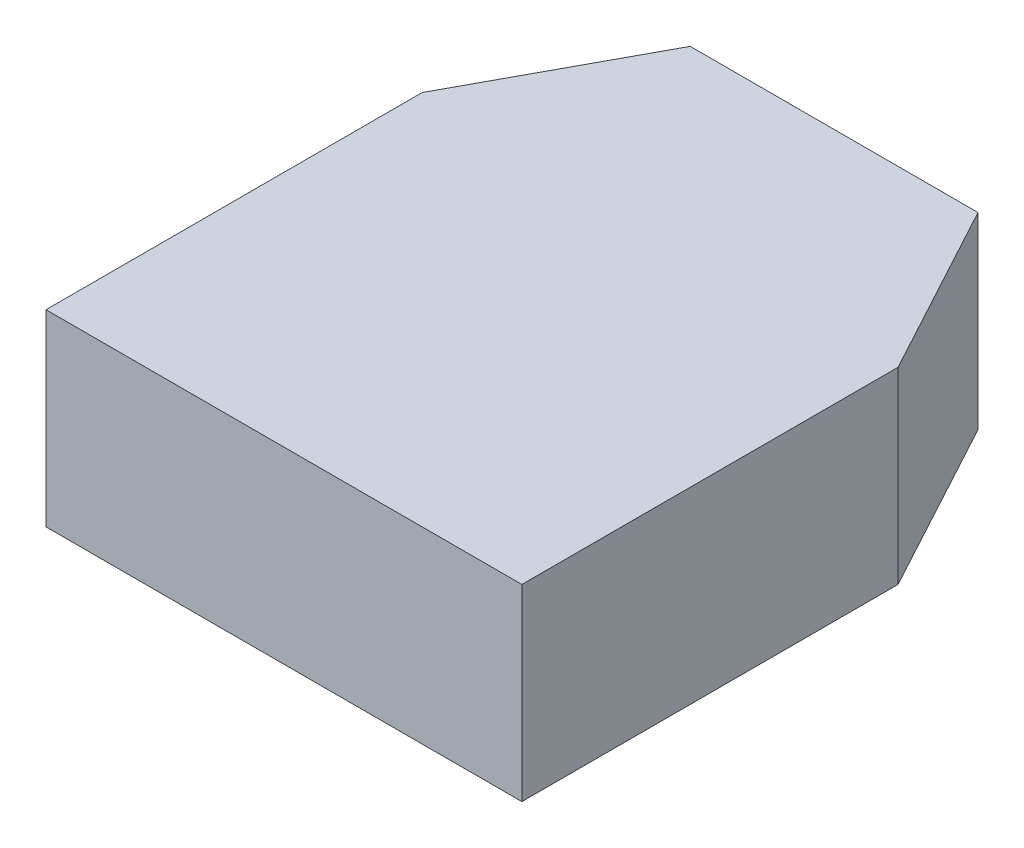
ISO-10303-21;
HEADER;
FILE_DESCRIPTION(('STEP AP214'),'2;1');
FILE_NAME('part.step','',(''),(''),'','','');
FILE_SCHEMA(('AUTOMOTIVE_DESIGN { 1 0 10303 214 1 1 1 1 }'));
ENDSEC;
DATA;
#1=APPLICATION_CONTEXT('core data for automotive mechanical design processes');
#2=APPLICATION_PROTOCOL_DEFINITION('international standard','automotive_design',2000,#1);
#3=PRODUCT_CONTEXT('',#1,'mechanical');
#4=PRODUCT('Part','Part','',(#3));
#5=PRODUCT_RELATED_PRODUCT_CATEGORY('part','',(#4));
#6=PRODUCT_DEFINITION_FORMATION('','',#4);
#7=PRODUCT_DEFINITION_CONTEXT('part definition',#1,'design');
#8=PRODUCT_DEFINITION('design','',#6,#7);
#9=PRODUCT_DEFINITION_SHAPE('','',#8);
#10=(LENGTH_UNIT() NAMED_UNIT(*) SI_UNIT(.MILLI.,.METRE.));
#11=(NAMED_UNIT(*) PLANE_ANGLE_UNIT() SI_UNIT($,.RADIAN.));
#12=(NAMED_UNIT(*) SI_UNIT($,.STERADIAN.) SOLID_ANGLE_UNIT());
#13=UNCERTAINTY_MEASURE_WITH_UNIT(LENGTH_MEASURE(1.E-05),#10,'distance_accuracy_value','');
#14=(GEOMETRIC_REPRESENTATION_CONTEXT(3) GLOBAL_UNCERTAINTY_ASSIGNED_CONTEXT((#13)) GLOBAL_UNIT_ASSIGNED_CONTEXT((#10,
#11,#12)) REPRESENTATION_CONTEXT('',''));
#15=CARTESIAN_POINT('',(0.,0.,0.));
#16=DIRECTION('',(0.,0.,1.));
#17=DIRECTION('',(1.,0.,0.));
#18=AXIS2_PLACEMENT_3D('',#15,#16,#17);
#19=CARTESIAN_POINT('',(-50.6,20.,0.));
#20=DIRECTION('',(1.,0.,0.));
#21=DIRECTION('',(0.,0.,-1.));
#22=AXIS2_PLACEMENT_3D('',#19,#20,#21);
#23=PLANE('',#22);
#24=DIRECTION('',(0.,0.,1.));
#25=VECTOR('',#24,1.);
#26=CARTESIAN_POINT('',(-50.6,0.,0.));
#27=LINE('',#26,#25);
#28=CARTESIAN_POINT('',(-50.6,0.,-40.));
#29=VERTEX_POINT('',#28);
#30=CARTESIAN_POINT('',(-50.6,0.,0.));
#31=VERTEX_POINT('',#30);
#32=EDGE_CURVE('E117',#29,#31,#27,.T.);
#33=ORIENTED_EDGE('',*,*,#32,.T.);
#34=DIRECTION('',(0.,-1.,0.));
#35=VECTOR('',#34,1.);
#36=CARTESIAN_POINT('',(-50.6,20.,0.));
#37=LINE('',#36,#35);
#38=CARTESIAN_POINT('',(-50.6,20.,0.));
#39=VERTEX_POINT('',#38);
#40=EDGE_CURVE('E11',#39,#31,#37,.T.);
#41=ORIENTED_EDGE('',*,*,#40,.F.);
#42=DIRECTION('',(0.,0.,1.));
#43=VECTOR('',#42,1.);
#44=CARTESIAN_POINT('',(-50.6,20.,0.));
#45=LINE('',#44,#43);
#46=CARTESIAN_POINT('',(-50.6,20.,-40.));
#47=VERTEX_POINT('',#46);
#48=EDGE_CURVE('E127',#47,#39,#45,.T.);
#49=ORIENTED_EDGE('',*,*,#48,.F.);
#50=DIRECTION('',(0.,-1.,0.));
#51=VECTOR('',#50,1.);
#52=CARTESIAN_POINT('',(-50.6,20.,-40.));
#53=LINE('',#52,#51);
#54=EDGE_CURVE('E113',#47,#29,#53,.T.);
#55=ORIENTED_EDGE('',*,*,#54,.T.);
#56=EDGE_LOOP('',(#33,#41,#49,#55));
#57=FACE_BOUND('',#56,.T.);
#58=ADVANCED_FACE('F33',(#57),#23,.F.);
#59=CARTESIAN_POINT('',(0.,20.,0.));
#60=DIRECTION('',(0.,0.,-1.));
#61=DIRECTION('',(-1.,0.,0.));
#62=AXIS2_PLACEMENT_3D('',#59,#60,#61);
#63=PLANE('',#62);
#64=DIRECTION('',(1.,0.,0.));
#65=VECTOR('',#64,1.);
#66=CARTESIAN_POINT('',(0.,0.,0.));
#67=LINE('',#66,#65);
#68=CARTESIAN_POINT('',(0.,0.,0.));
#69=VERTEX_POINT('',#68);
#70=EDGE_CURVE('E120',#31,#69,#67,.T.);
#71=ORIENTED_EDGE('',*,*,#70,.T.);
#72=DIRECTION('',(0.,-1.,0.));
#73=VECTOR('',#72,1.);
#74=CARTESIAN_POINT('',(0.,20.,0.));
#75=LINE('',#74,#73);
#76=CARTESIAN_POINT('',(0.,20.,0.));
#77=VERTEX_POINT('',#76);
#78=EDGE_CURVE('E41',#77,#69,#75,.T.);
#79=ORIENTED_EDGE('',*,*,#78,.F.);
#80=DIRECTION('',(1.,0.,0.));
#81=VECTOR('',#80,1.);
#82=CARTESIAN_POINT('',(0.,20.,0.));
#83=LINE('',#82,#81);
#84=EDGE_CURVE('E86',#39,#77,#83,.T.);
#85=ORIENTED_EDGE('',*,*,#84,.F.);
#86=ORIENTED_EDGE('',*,*,#40,.T.);
#87=EDGE_LOOP('',(#71,#79,#85,#86));
#88=FACE_BOUND('',#87,.T.);
#89=ADVANCED_FACE('F151',(#88),#63,.F.);
#90=CARTESIAN_POINT('',(0.,20.,-40.));
#91=DIRECTION('',(-1.,0.,0.));
#92=DIRECTION('',(0.,0.,1.));
#93=AXIS2_PLACEMENT_3D('',#90,#91,#92);
#94=PLANE('',#93);
#95=DIRECTION('',(0.,0.,-1.));
#96=VECTOR('',#95,1.);
#97=CARTESIAN_POINT('',(0.,0.,-40.));
#98=LINE('',#97,#96);
#99=CARTESIAN_POINT('',(0.,0.,-40.));
#100=VERTEX_POINT('',#99);
#101=EDGE_CURVE('E122',#69,#100,#98,.T.);
#102=ORIENTED_EDGE('',*,*,#101,.T.);
#103=DIRECTION('',(0.,-1.,0.));
#104=VECTOR('',#103,1.);
#105=CARTESIAN_POINT('',(0.,20.,-40.));
#106=LINE('',#105,#104);
#107=CARTESIAN_POINT('',(0.,20.,-40.));
#108=VERTEX_POINT('',#107);
#109=EDGE_CURVE('E108',#108,#100,#106,.T.);
#110=ORIENTED_EDGE('',*,*,#109,.F.);
#111=DIRECTION('',(0.,0.,-1.));
#112=VECTOR('',#111,1.);
#113=CARTESIAN_POINT('',(0.,20.,-40.));
#114=LINE('',#113,#112);
#115=EDGE_CURVE('E99',#77,#108,#114,.T.);
#116=ORIENTED_EDGE('',*,*,#115,.F.);
#117=ORIENTED_EDGE('',*,*,#78,.T.);
#118=EDGE_LOOP('',(#102,#110,#116,#117));
#119=FACE_BOUND('',#118,.T.);
#120=ADVANCED_FACE('F133',(#119),#94,.F.);
#121=CARTESIAN_POINT('',(-9.99999999999999,20.,-58.5));
#122=DIRECTION('',(-0.879706513576127,0.,0.475517034365474));
#123=DIRECTION('',(0.475517034365474,0.,0.879706513576127));
#124=AXIS2_PLACEMENT_3D('',#121,#122,#123);
#125=PLANE('',#124);
#126=DIRECTION('',(-0.475517034365474,0.,-0.879706513576127));
#127=VECTOR('',#126,1.);
#128=CARTESIAN_POINT('',(-9.99999999999999,0.,-58.5));
#129=LINE('',#128,#127);
#130=CARTESIAN_POINT('',(-9.99999999999999,0.,-58.5));
#131=VERTEX_POINT('',#130);
#132=EDGE_CURVE('E107',#100,#131,#129,.T.);
#133=ORIENTED_EDGE('',*,*,#132,.T.);
#134=DIRECTION('',(0.,-1.,0.));
#135=VECTOR('',#134,1.);
#136=CARTESIAN_POINT('',(-9.99999999999999,20.,-58.5));
#137=LINE('',#136,#135);
#138=CARTESIAN_POINT('',(-9.99999999999999,20.,-58.5));
#139=VERTEX_POINT('',#138);
#140=EDGE_CURVE('E104',#139,#131,#137,.T.);
#141=ORIENTED_EDGE('',*,*,#140,.F.);
#142=DIRECTION('',(-0.475517034365474,0.,-0.879706513576127));
#143=VECTOR('',#142,1.);
#144=CARTESIAN_POINT('',(-9.99999999999999,20.,-58.5));
#145=LINE('',#144,#143);
#146=EDGE_CURVE('E93',#108,#139,#145,.T.);
#147=ORIENTED_EDGE('',*,*,#146,.F.);
#148=ORIENTED_EDGE('',*,*,#109,.T.);
#149=EDGE_LOOP('',(#133,#141,#147,#148));
#150=FACE_BOUND('',#149,.T.);
#151=ADVANCED_FACE('F105',(#150),#125,.F.);
#152=CARTESIAN_POINT('',(-40.6,20.,-58.5));
#153=DIRECTION('',(0.,0.,1.));
#154=DIRECTION('',(1.,0.,0.));
#155=AXIS2_PLACEMENT_3D('',#152,#153,#154);
#156=PLANE('',#155);
#157=DIRECTION('',(-1.,0.,0.));
#158=VECTOR('',#157,1.);
#159=CARTESIAN_POINT('',(-40.6,0.,-58.5));
#160=LINE('',#159,#158);
#161=CARTESIAN_POINT('',(-40.6,0.,-58.5));
#162=VERTEX_POINT('',#161);
#163=EDGE_CURVE('E72',#131,#162,#160,.T.);
#164=ORIENTED_EDGE('',*,*,#163,.T.);
#165=DIRECTION('',(0.,-1.,0.));
#166=VECTOR('',#165,1.);
#167=CARTESIAN_POINT('',(-40.6,20.,-58.5));
#168=LINE('',#167,#166);
#169=CARTESIAN_POINT('',(-40.6,20.,-58.5));
#170=VERTEX_POINT('',#169);
#171=EDGE_CURVE('E109',#170,#162,#168,.T.);
#172=ORIENTED_EDGE('',*,*,#171,.F.);
#173=DIRECTION('',(-1.,0.,0.));
#174=VECTOR('',#173,1.);
#175=CARTESIAN_POINT('',(-40.6,20.,-58.5));
#176=LINE('',#175,#174);
#177=EDGE_CURVE('E97',#139,#170,#176,.T.);
#178=ORIENTED_EDGE('',*,*,#177,.F.);
#179=ORIENTED_EDGE('',*,*,#140,.T.);
#180=EDGE_LOOP('',(#164,#172,#178,#179));
#181=FACE_BOUND('',#180,.T.);
#182=ADVANCED_FACE('F111',(#181),#156,.F.);
#183=CARTESIAN_POINT('',(-50.6,20.,-40.));
#184=DIRECTION('',(0.879706513576127,0.,0.475517034365474));
#185=DIRECTION('',(0.475517034365474,0.,-0.879706513576127));
#186=AXIS2_PLACEMENT_3D('',#183,#184,#185);
#187=PLANE('',#186);
#188=DIRECTION('',(-0.475517034365474,0.,0.879706513576127));
#189=VECTOR('',#188,1.);
#190=CARTESIAN_POINT('',(-50.6,0.,-40.));
#191=LINE('',#190,#189);
#192=EDGE_CURVE('E78',#162,#29,#191,.T.);
#193=ORIENTED_EDGE('',*,*,#192,.T.);
#194=ORIENTED_EDGE('',*,*,#54,.F.);
#195=DIRECTION('',(-0.475517034365474,0.,0.879706513576127));
#196=VECTOR('',#195,1.);
#197=CARTESIAN_POINT('',(-50.6,20.,-40.));
#198=LINE('',#197,#196);
#199=EDGE_CURVE('E49',#170,#47,#198,.T.);
#200=ORIENTED_EDGE('',*,*,#199,.F.);
#201=ORIENTED_EDGE('',*,*,#171,.T.);
#202=EDGE_LOOP('',(#193,#194,#200,#201));
#203=FACE_BOUND('',#202,.T.);
#204=ADVANCED_FACE('F140',(#203),#187,.F.);
#205=CARTESIAN_POINT('',(0.,20.,0.));
#206=DIRECTION('',(0.,-1.,0.));
#207=DIRECTION('',(0.,0.,-1.));
#208=AXIS2_PLACEMENT_3D('',#205,#206,#207);
#209=PLANE('',#208);
#210=ORIENTED_EDGE('',*,*,#48,.T.);
#211=ORIENTED_EDGE('',*,*,#84,.T.);
#212=ORIENTED_EDGE('',*,*,#115,.T.);
#213=ORIENTED_EDGE('',*,*,#146,.T.);
#214=ORIENTED_EDGE('',*,*,#177,.T.);
#215=ORIENTED_EDGE('',*,*,#199,.T.);
#216=EDGE_LOOP('',(#210,#211,#212,#213,#214,#215));
#217=FACE_BOUND('',#216,.T.);
#218=ADVANCED_FACE('F95',(#217),#209,.F.);
#219=CARTESIAN_POINT('',(0.,0.,0.));
#220=DIRECTION('',(0.,-1.,0.));
#221=DIRECTION('',(0.,0.,-1.));
#222=AXIS2_PLACEMENT_3D('',#219,#220,#221);
#223=PLANE('',#222);
#224=ORIENTED_EDGE('',*,*,#32,.F.);
#225=ORIENTED_EDGE('',*,*,#192,.F.);
#226=ORIENTED_EDGE('',*,*,#163,.F.);
#227=ORIENTED_EDGE('',*,*,#132,.F.);
#228=ORIENTED_EDGE('',*,*,#101,.F.);
#229=ORIENTED_EDGE('',*,*,#70,.F.);
#230=EDGE_LOOP('',(#224,#225,#226,#227,#228,#229));
#231=FACE_BOUND('',#230,.T.);
#232=ADVANCED_FACE('F136',(#231),#223,.T.);
#233=CLOSED_SHELL('',(#58,#89,#120,#151,#182,#204,#218,#232));
#234=MANIFOLD_SOLID_BREP('B2',#233);
#235=ADVANCED_BREP_SHAPE_REPRESENTATION('',(#18,#234),#14);
#236=SHAPE_DEFINITION_REPRESENTATION(#9,#235);
ENDSEC;
END-ISO-10303-21;
